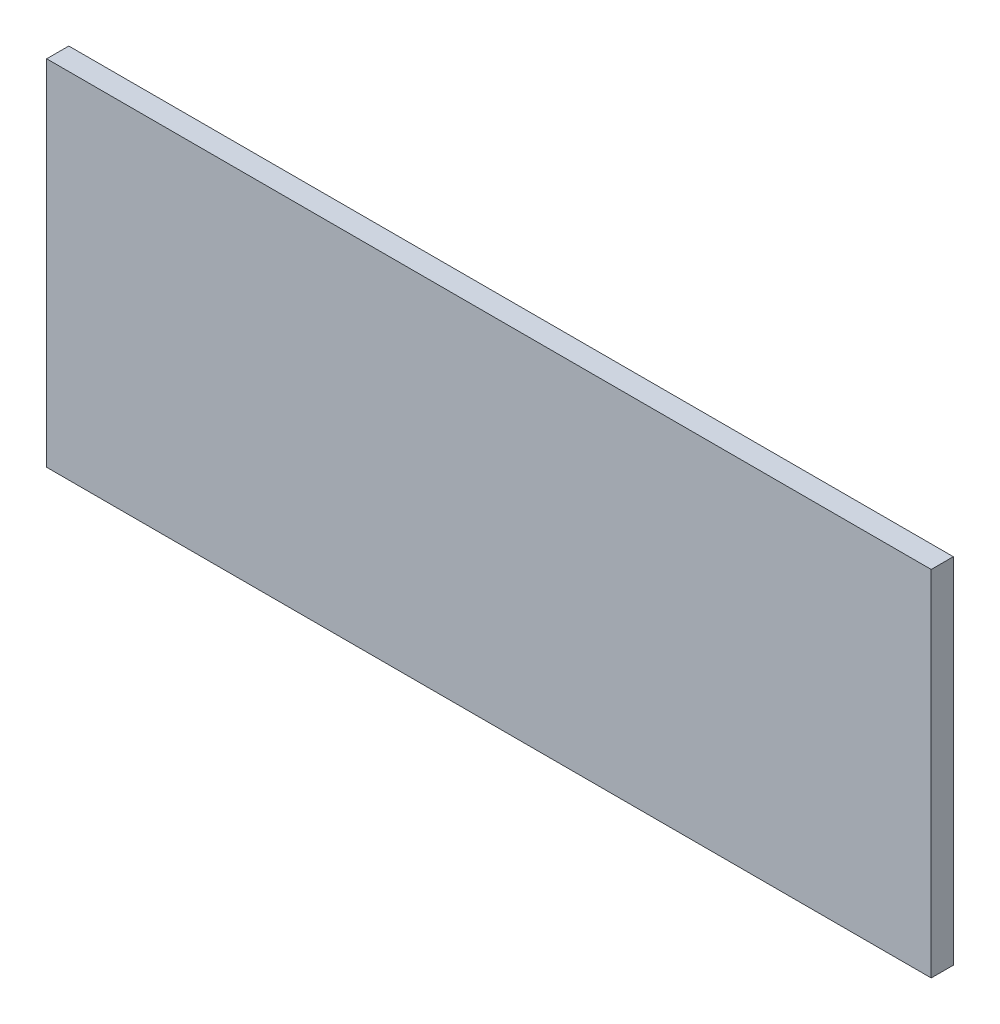
ISO-10303-21;
HEADER;
FILE_DESCRIPTION(('STEP AP214'),'2;1');
FILE_NAME('part.step','',(''),(''),'','','');
FILE_SCHEMA(('AUTOMOTIVE_DESIGN { 1 0 10303 214 1 1 1 1 }'));
ENDSEC;
DATA;
#1=APPLICATION_CONTEXT('core data for automotive mechanical design processes');
#2=APPLICATION_PROTOCOL_DEFINITION('international standard','automotive_design',2000,#1);
#3=PRODUCT_CONTEXT('',#1,'mechanical');
#4=PRODUCT('Part','Part','',(#3));
#5=PRODUCT_RELATED_PRODUCT_CATEGORY('part','',(#4));
#6=PRODUCT_DEFINITION_FORMATION('','',#4);
#7=PRODUCT_DEFINITION_CONTEXT('part definition',#1,'design');
#8=PRODUCT_DEFINITION('design','',#6,#7);
#9=PRODUCT_DEFINITION_SHAPE('','',#8);
#10=(LENGTH_UNIT() NAMED_UNIT(*) SI_UNIT(.MILLI.,.METRE.));
#11=(NAMED_UNIT(*) PLANE_ANGLE_UNIT() SI_UNIT($,.RADIAN.));
#12=(NAMED_UNIT(*) SI_UNIT($,.STERADIAN.) SOLID_ANGLE_UNIT());
#13=UNCERTAINTY_MEASURE_WITH_UNIT(LENGTH_MEASURE(1.E-05),#10,'distance_accuracy_value','');
#14=(GEOMETRIC_REPRESENTATION_CONTEXT(3) GLOBAL_UNCERTAINTY_ASSIGNED_CONTEXT((#13)) GLOBAL_UNIT_ASSIGNED_CONTEXT((#10,
#11,#12)) REPRESENTATION_CONTEXT('',''));
#15=CARTESIAN_POINT('',(0.,0.,0.));
#16=DIRECTION('',(0.,0.,1.));
#17=DIRECTION('',(1.,0.,0.));
#18=AXIS2_PLACEMENT_3D('',#15,#16,#17);
#19=CARTESIAN_POINT('',(63.5,-25.4,1.5875));
#20=DIRECTION('',(-1.,0.,0.));
#21=DIRECTION('',(0.,0.,1.));
#22=AXIS2_PLACEMENT_3D('',#19,#20,#21);
#23=PLANE('',#22);
#24=DIRECTION('',(0.,1.,0.));
#25=VECTOR('',#24,1.);
#26=CARTESIAN_POINT('',(63.5,-25.4,-1.5875));
#27=LINE('',#26,#25);
#28=CARTESIAN_POINT('',(63.5,-25.4,-1.5875));
#29=VERTEX_POINT('',#28);
#30=CARTESIAN_POINT('',(63.5,25.4,-1.5875));
#31=VERTEX_POINT('',#30);
#32=EDGE_CURVE('E107',#29,#31,#27,.T.);
#33=ORIENTED_EDGE('',*,*,#32,.T.);
#34=DIRECTION('',(0.,0.,-1.));
#35=VECTOR('',#34,1.);
#36=CARTESIAN_POINT('',(63.5,25.4,1.5875));
#37=LINE('',#36,#35);
#38=CARTESIAN_POINT('',(63.5,25.4,1.5875));
#39=VERTEX_POINT('',#38);
#40=EDGE_CURVE('E11',#39,#31,#37,.T.);
#41=ORIENTED_EDGE('',*,*,#40,.F.);
#42=DIRECTION('',(0.,1.,0.));
#43=VECTOR('',#42,1.);
#44=CARTESIAN_POINT('',(63.5,-25.4,1.5875));
#45=LINE('',#44,#43);
#46=CARTESIAN_POINT('',(63.5,-25.4,1.5875));
#47=VERTEX_POINT('',#46);
#48=EDGE_CURVE('E91',#47,#39,#45,.T.);
#49=ORIENTED_EDGE('',*,*,#48,.F.);
#50=DIRECTION('',(0.,0.,-1.));
#51=VECTOR('',#50,1.);
#52=CARTESIAN_POINT('',(63.5,-25.4,1.5875));
#53=LINE('',#52,#51);
#54=EDGE_CURVE('E103',#47,#29,#53,.T.);
#55=ORIENTED_EDGE('',*,*,#54,.T.);
#56=EDGE_LOOP('',(#33,#41,#49,#55));
#57=FACE_BOUND('',#56,.T.);
#58=ADVANCED_FACE('F39',(#57),#23,.F.);
#59=CARTESIAN_POINT('',(-63.5,25.4,1.5875));
#60=DIRECTION('',(0.,-1.,0.));
#61=DIRECTION('',(0.,0.,-1.));
#62=AXIS2_PLACEMENT_3D('',#59,#60,#61);
#63=PLANE('',#62);
#64=DIRECTION('',(-1.,0.,0.));
#65=VECTOR('',#64,1.);
#66=CARTESIAN_POINT('',(-63.5,25.4,-1.5875));
#67=LINE('',#66,#65);
#68=CARTESIAN_POINT('',(-63.5,25.4,-1.5875));
#69=VERTEX_POINT('',#68);
#70=EDGE_CURVE('E96',#31,#69,#67,.T.);
#71=ORIENTED_EDGE('',*,*,#70,.T.);
#72=DIRECTION('',(0.,0.,-1.));
#73=VECTOR('',#72,1.);
#74=CARTESIAN_POINT('',(-63.5,25.4,1.5875));
#75=LINE('',#74,#73);
#76=CARTESIAN_POINT('',(-63.5,25.4,1.5875));
#77=VERTEX_POINT('',#76);
#78=EDGE_CURVE('E48',#77,#69,#75,.T.);
#79=ORIENTED_EDGE('',*,*,#78,.F.);
#80=DIRECTION('',(-1.,0.,0.));
#81=VECTOR('',#80,1.);
#82=CARTESIAN_POINT('',(-63.5,25.4,1.5875));
#83=LINE('',#82,#81);
#84=EDGE_CURVE('E86',#39,#77,#83,.T.);
#85=ORIENTED_EDGE('',*,*,#84,.F.);
#86=ORIENTED_EDGE('',*,*,#40,.T.);
#87=EDGE_LOOP('',(#71,#79,#85,#86));
#88=FACE_BOUND('',#87,.T.);
#89=ADVANCED_FACE('F95',(#88),#63,.F.);
#90=CARTESIAN_POINT('',(-63.5,-25.4,1.5875));
#91=DIRECTION('',(1.,0.,0.));
#92=DIRECTION('',(0.,0.,-1.));
#93=AXIS2_PLACEMENT_3D('',#90,#91,#92);
#94=PLANE('',#93);
#95=DIRECTION('',(0.,-1.,0.));
#96=VECTOR('',#95,1.);
#97=CARTESIAN_POINT('',(-63.5,-25.4,-1.5875));
#98=LINE('',#97,#96);
#99=CARTESIAN_POINT('',(-63.5,-25.4,-1.5875));
#100=VERTEX_POINT('',#99);
#101=EDGE_CURVE('E73',#69,#100,#98,.T.);
#102=ORIENTED_EDGE('',*,*,#101,.T.);
#103=DIRECTION('',(0.,0.,-1.));
#104=VECTOR('',#103,1.);
#105=CARTESIAN_POINT('',(-63.5,-25.4,1.5875));
#106=LINE('',#105,#104);
#107=CARTESIAN_POINT('',(-63.5,-25.4,1.5875));
#108=VERTEX_POINT('',#107);
#109=EDGE_CURVE('E98',#108,#100,#106,.T.);
#110=ORIENTED_EDGE('',*,*,#109,.F.);
#111=DIRECTION('',(0.,-1.,0.));
#112=VECTOR('',#111,1.);
#113=CARTESIAN_POINT('',(-63.5,-25.4,1.5875));
#114=LINE('',#113,#112);
#115=EDGE_CURVE('E89',#77,#108,#114,.T.);
#116=ORIENTED_EDGE('',*,*,#115,.F.);
#117=ORIENTED_EDGE('',*,*,#78,.T.);
#118=EDGE_LOOP('',(#102,#110,#116,#117));
#119=FACE_BOUND('',#118,.T.);
#120=ADVANCED_FACE('F99',(#119),#94,.F.);
#121=CARTESIAN_POINT('',(-63.5,-25.4,1.5875));
#122=DIRECTION('',(0.,1.,0.));
#123=DIRECTION('',(0.,0.,1.));
#124=AXIS2_PLACEMENT_3D('',#121,#122,#123);
#125=PLANE('',#124);
#126=DIRECTION('',(1.,0.,0.));
#127=VECTOR('',#126,1.);
#128=CARTESIAN_POINT('',(-63.5,-25.4,-1.5875));
#129=LINE('',#128,#127);
#130=EDGE_CURVE('E79',#100,#29,#129,.T.);
#131=ORIENTED_EDGE('',*,*,#130,.T.);
#132=ORIENTED_EDGE('',*,*,#54,.F.);
#133=DIRECTION('',(1.,0.,0.));
#134=VECTOR('',#133,1.);
#135=CARTESIAN_POINT('',(-63.5,-25.4,1.5875));
#136=LINE('',#135,#134);
#137=EDGE_CURVE('E56',#108,#47,#136,.T.);
#138=ORIENTED_EDGE('',*,*,#137,.F.);
#139=ORIENTED_EDGE('',*,*,#109,.T.);
#140=EDGE_LOOP('',(#131,#132,#138,#139));
#141=FACE_BOUND('',#140,.T.);
#142=ADVANCED_FACE('F120',(#141),#125,.F.);
#143=CARTESIAN_POINT('',(0.,0.,1.5875));
#144=DIRECTION('',(0.,0.,-1.));
#145=DIRECTION('',(-1.,0.,0.));
#146=AXIS2_PLACEMENT_3D('',#143,#144,#145);
#147=PLANE('',#146);
#148=ORIENTED_EDGE('',*,*,#48,.T.);
#149=ORIENTED_EDGE('',*,*,#84,.T.);
#150=ORIENTED_EDGE('',*,*,#115,.T.);
#151=ORIENTED_EDGE('',*,*,#137,.T.);
#152=EDGE_LOOP('',(#148,#149,#150,#151));
#153=FACE_BOUND('',#152,.T.);
#154=ADVANCED_FACE('F87',(#153),#147,.F.);
#155=CARTESIAN_POINT('',(0.,0.,-1.5875));
#156=DIRECTION('',(0.,0.,-1.));
#157=DIRECTION('',(-1.,0.,0.));
#158=AXIS2_PLACEMENT_3D('',#155,#156,#157);
#159=PLANE('',#158);
#160=ORIENTED_EDGE('',*,*,#32,.F.);
#161=ORIENTED_EDGE('',*,*,#130,.F.);
#162=ORIENTED_EDGE('',*,*,#101,.F.);
#163=ORIENTED_EDGE('',*,*,#70,.F.);
#164=EDGE_LOOP('',(#160,#161,#162,#163));
#165=FACE_BOUND('',#164,.T.);
#166=ADVANCED_FACE('F123',(#165),#159,.T.);
#167=CLOSED_SHELL('',(#58,#89,#120,#142,#154,#166));
#168=MANIFOLD_SOLID_BREP('B2',#167);
#169=ADVANCED_BREP_SHAPE_REPRESENTATION('',(#18,#168),#14);
#170=SHAPE_DEFINITION_REPRESENTATION(#9,#169);
ENDSEC;
END-ISO-10303-21;
